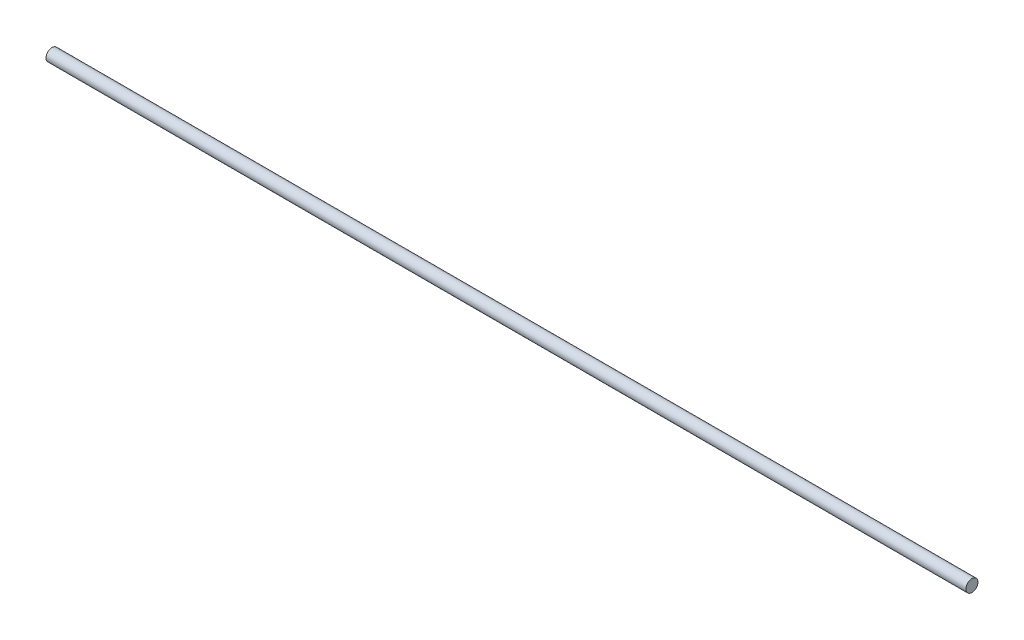
ISO-10303-21;
HEADER;
FILE_DESCRIPTION(('STEP AP214'),'2;1');
FILE_NAME('part.step','',(''),(''),'','','');
FILE_SCHEMA(('AUTOMOTIVE_DESIGN { 1 0 10303 214 1 1 1 1 }'));
ENDSEC;
DATA;
#1=APPLICATION_CONTEXT('core data for automotive mechanical design processes');
#2=APPLICATION_PROTOCOL_DEFINITION('international standard','automotive_design',2000,#1);
#3=PRODUCT_CONTEXT('',#1,'mechanical');
#4=PRODUCT('Part','Part','',(#3));
#5=PRODUCT_RELATED_PRODUCT_CATEGORY('part','',(#4));
#6=PRODUCT_DEFINITION_FORMATION('','',#4);
#7=PRODUCT_DEFINITION_CONTEXT('part definition',#1,'design');
#8=PRODUCT_DEFINITION('design','',#6,#7);
#9=PRODUCT_DEFINITION_SHAPE('','',#8);
#10=(LENGTH_UNIT() NAMED_UNIT(*) SI_UNIT(.MILLI.,.METRE.));
#11=(NAMED_UNIT(*) PLANE_ANGLE_UNIT() SI_UNIT($,.RADIAN.));
#12=(NAMED_UNIT(*) SI_UNIT($,.STERADIAN.) SOLID_ANGLE_UNIT());
#13=UNCERTAINTY_MEASURE_WITH_UNIT(LENGTH_MEASURE(1.E-05),#10,'distance_accuracy_value','');
#14=(GEOMETRIC_REPRESENTATION_CONTEXT(3) GLOBAL_UNCERTAINTY_ASSIGNED_CONTEXT((#13)) GLOBAL_UNIT_ASSIGNED_CONTEXT((#10,
#11,#12)) REPRESENTATION_CONTEXT('',''));
#15=CARTESIAN_POINT('',(0.,0.,0.));
#16=DIRECTION('',(0.,0.,1.));
#17=DIRECTION('',(1.,0.,0.));
#18=AXIS2_PLACEMENT_3D('',#15,#16,#17);
#19=CARTESIAN_POINT('',(241.3,0.,0.));
#20=DIRECTION('',(1.,0.,0.));
#21=DIRECTION('',(0.,0.,-1.));
#22=AXIS2_PLACEMENT_3D('',#19,#20,#21);
#23=PLANE('',#22);
#24=CARTESIAN_POINT('',(241.3,0.,0.));
#25=DIRECTION('',(1.,0.,0.));
#26=DIRECTION('',(0.,0.,-1.));
#27=AXIS2_PLACEMENT_3D('',#24,#25,#26);
#28=CIRCLE('',#27,3.175);
#29=CARTESIAN_POINT('',(241.3,0.,-3.175));
#30=VERTEX_POINT('',#29);
#31=EDGE_CURVE('E18',#30,#30,#28,.F.);
#32=ORIENTED_EDGE('',*,*,#31,.F.);
#33=EDGE_LOOP('',(#32));
#34=FACE_BOUND('',#33,.T.);
#35=ADVANCED_FACE('F15',(#34),#23,.T.);
#36=CARTESIAN_POINT('',(-241.3,0.,0.));
#37=DIRECTION('',(1.,0.,0.));
#38=DIRECTION('',(0.,0.,-1.));
#39=AXIS2_PLACEMENT_3D('',#36,#37,#38);
#40=PLANE('',#39);
#41=CARTESIAN_POINT('',(-241.3,0.,0.));
#42=DIRECTION('',(1.,0.,0.));
#43=DIRECTION('',(0.,0.,-1.));
#44=AXIS2_PLACEMENT_3D('',#41,#42,#43);
#45=CIRCLE('',#44,3.175);
#46=CARTESIAN_POINT('',(-241.3,0.,-3.175));
#47=VERTEX_POINT('',#46);
#48=EDGE_CURVE('E10',#47,#47,#45,.T.);
#49=ORIENTED_EDGE('',*,*,#48,.F.);
#50=EDGE_LOOP('',(#49));
#51=FACE_BOUND('',#50,.T.);
#52=ADVANCED_FACE('F30',(#51),#40,.F.);
#53=CARTESIAN_POINT('',(-241.3,0.,0.));
#54=DIRECTION('',(1.,0.,0.));
#55=DIRECTION('',(0.,0.,-1.));
#56=AXIS2_PLACEMENT_3D('',#53,#54,#55);
#57=CYLINDRICAL_SURFACE('',#56,3.175);
#58=ORIENTED_EDGE('',*,*,#31,.T.);
#59=EDGE_LOOP('',(#58));
#60=FACE_BOUND('',#59,.T.);
#61=ORIENTED_EDGE('',*,*,#48,.T.);
#62=EDGE_LOOP('',(#61));
#63=FACE_BOUND('',#62,.T.);
#64=ADVANCED_FACE('F27',(#60,#63),#57,.T.);
#65=CLOSED_SHELL('',(#35,#52,#64));
#66=MANIFOLD_SOLID_BREP('B1',#65);
#67=ADVANCED_BREP_SHAPE_REPRESENTATION('',(#18,#66),#14);
#68=SHAPE_DEFINITION_REPRESENTATION(#9,#67);
ENDSEC;
END-ISO-10303-21;
